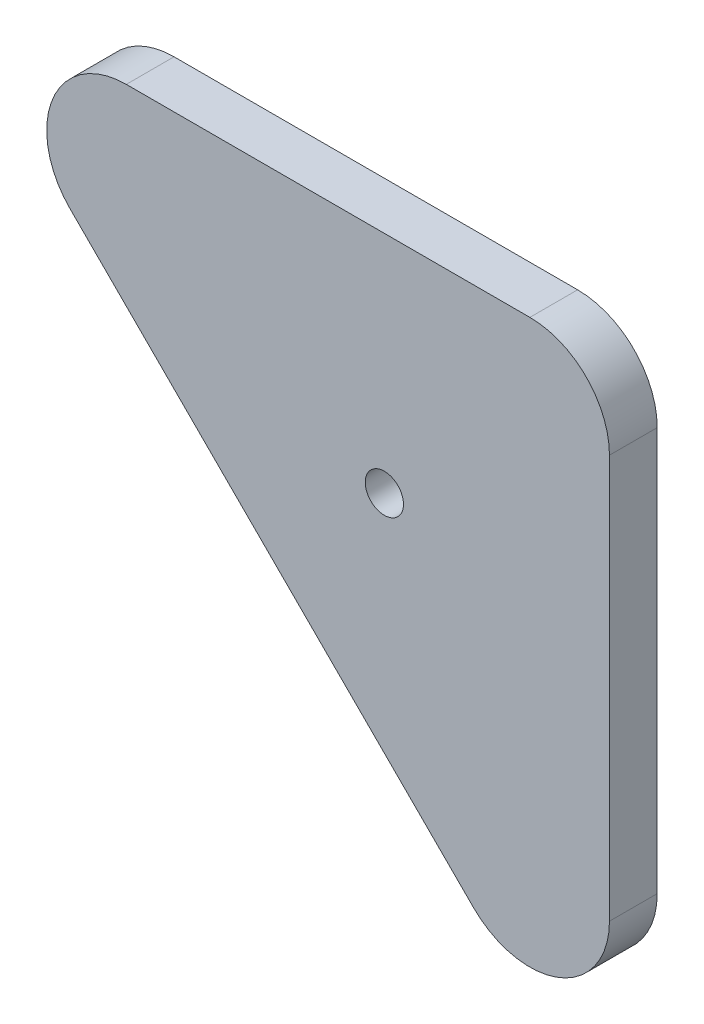
ISO-10303-21;
HEADER;
FILE_DESCRIPTION(('STEP AP214'),'2;1');
FILE_NAME('part.step','',(''),(''),'','','');
FILE_SCHEMA(('AUTOMOTIVE_DESIGN { 1 0 10303 214 1 1 1 1 }'));
ENDSEC;
DATA;
#1=APPLICATION_CONTEXT('core data for automotive mechanical design processes');
#2=APPLICATION_PROTOCOL_DEFINITION('international standard','automotive_design',2000,#1);
#3=PRODUCT_CONTEXT('',#1,'mechanical');
#4=PRODUCT('Part','Part','',(#3));
#5=PRODUCT_RELATED_PRODUCT_CATEGORY('part','',(#4));
#6=PRODUCT_DEFINITION_FORMATION('','',#4);
#7=PRODUCT_DEFINITION_CONTEXT('part definition',#1,'design');
#8=PRODUCT_DEFINITION('design','',#6,#7);
#9=PRODUCT_DEFINITION_SHAPE('','',#8);
#10=(LENGTH_UNIT() NAMED_UNIT(*) SI_UNIT(.MILLI.,.METRE.));
#11=(NAMED_UNIT(*) PLANE_ANGLE_UNIT() SI_UNIT($,.RADIAN.));
#12=(NAMED_UNIT(*) SI_UNIT($,.STERADIAN.) SOLID_ANGLE_UNIT());
#13=UNCERTAINTY_MEASURE_WITH_UNIT(LENGTH_MEASURE(1.E-05),#10,'distance_accuracy_value','');
#14=(GEOMETRIC_REPRESENTATION_CONTEXT(3) GLOBAL_UNCERTAINTY_ASSIGNED_CONTEXT((#13)) GLOBAL_UNIT_ASSIGNED_CONTEXT((#10,
#11,#12)) REPRESENTATION_CONTEXT('',''));
#15=CARTESIAN_POINT('',(0.,0.,0.));
#16=DIRECTION('',(0.,0.,1.));
#17=DIRECTION('',(1.,0.,0.));
#18=AXIS2_PLACEMENT_3D('',#15,#16,#17);
#19=CARTESIAN_POINT('',(509.289321881343,559.999999999999,6.));
#20=DIRECTION('',(0.,0.,-1.));
#21=DIRECTION('',(-1.,0.,0.));
#22=AXIS2_PLACEMENT_3D('',#19,#20,#21);
#23=PLANE('',#22);
#24=CARTESIAN_POINT('',(509.289321881343,559.999999999999,6.));
#25=DIRECTION('',(0.,0.,1.));
#26=DIRECTION('',(-1.,0.,0.));
#27=AXIS2_PLACEMENT_3D('',#24,#25,#26);
#28=CIRCLE('',#27,10.);
#29=CARTESIAN_POINT('',(509.289321881343,569.999999999999,6.));
#30=VERTEX_POINT('',#29);
#31=CARTESIAN_POINT('',(502.218254069477,552.928932188133,6.));
#32=VERTEX_POINT('',#31);
#33=EDGE_CURVE('E126',#30,#32,#28,.T.);
#34=ORIENTED_EDGE('',*,*,#33,.T.);
#35=DIRECTION('',(0.707106781186557,-0.707106781186538,0.));
#36=VECTOR('',#35,1.);
#37=CARTESIAN_POINT('',(552.928932188133,502.218254069479,6.));
#38=LINE('',#37,#36);
#39=CARTESIAN_POINT('',(552.928932188133,502.218254069479,6.));
#40=VERTEX_POINT('',#39);
#41=EDGE_CURVE('E84',#32,#40,#38,.T.);
#42=ORIENTED_EDGE('',*,*,#41,.T.);
#43=CARTESIAN_POINT('',(559.999999999999,509.289321881344,6.));
#44=DIRECTION('',(0.,0.,1.));
#45=DIRECTION('',(1.,0.,0.));
#46=AXIS2_PLACEMENT_3D('',#43,#44,#45);
#47=CIRCLE('',#46,10.);
#48=CARTESIAN_POINT('',(569.999999999999,509.289321881344,6.));
#49=VERTEX_POINT('',#48);
#50=EDGE_CURVE('E97',#40,#49,#47,.T.);
#51=ORIENTED_EDGE('',*,*,#50,.T.);
#52=DIRECTION('',(0.,1.,0.));
#53=VECTOR('',#52,1.);
#54=CARTESIAN_POINT('',(569.999999999999,559.999999999999,6.));
#55=LINE('',#54,#53);
#56=CARTESIAN_POINT('',(569.999999999999,559.999999999999,6.));
#57=VERTEX_POINT('',#56);
#58=EDGE_CURVE('E91',#49,#57,#55,.T.);
#59=ORIENTED_EDGE('',*,*,#58,.T.);
#60=CARTESIAN_POINT('',(559.999999999999,559.999999999999,6.));
#61=DIRECTION('',(0.,0.,1.));
#62=DIRECTION('',(-1.,0.,0.));
#63=AXIS2_PLACEMENT_3D('',#60,#61,#62);
#64=CIRCLE('',#63,9.99999999999995);
#65=CARTESIAN_POINT('',(559.999999999999,569.999999999999,6.));
#66=VERTEX_POINT('',#65);
#67=EDGE_CURVE('E95',#57,#66,#64,.T.);
#68=ORIENTED_EDGE('',*,*,#67,.T.);
#69=DIRECTION('',(-1.,0.,0.));
#70=VECTOR('',#69,1.);
#71=CARTESIAN_POINT('',(509.289321881343,569.999999999999,6.));
#72=LINE('',#71,#70);
#73=EDGE_CURVE('E47',#66,#30,#72,.T.);
#74=ORIENTED_EDGE('',*,*,#73,.T.);
#75=EDGE_LOOP('',(#34,#42,#51,#59,#68,#74));
#76=FACE_BOUND('',#75,.T.);
#77=CARTESIAN_POINT('',(541.715728752537,541.715728752536,6.));
#78=DIRECTION('',(0.,0.,1.));
#79=DIRECTION('',(1.,0.,0.));
#80=AXIS2_PLACEMENT_3D('',#77,#78,#79);
#81=CIRCLE('',#80,2.4000000000001);
#82=CARTESIAN_POINT('',(544.115728752537,541.715728752536,6.));
#83=VERTEX_POINT('',#82);
#84=EDGE_CURVE('E119',#83,#83,#81,.T.);
#85=ORIENTED_EDGE('',*,*,#84,.F.);
#86=EDGE_LOOP('',(#85));
#87=FACE_BOUND('',#86,.T.);
#88=ADVANCED_FACE('F30',(#76,#87),#23,.F.);
#89=CARTESIAN_POINT('',(509.289321881343,559.999999999999,0.));
#90=DIRECTION('',(0.,0.,-1.));
#91=DIRECTION('',(-1.,0.,0.));
#92=AXIS2_PLACEMENT_3D('',#89,#90,#91);
#93=PLANE('',#92);
#94=CARTESIAN_POINT('',(509.289321881343,559.999999999999,0.));
#95=DIRECTION('',(0.,0.,1.));
#96=DIRECTION('',(-1.,0.,0.));
#97=AXIS2_PLACEMENT_3D('',#94,#95,#96);
#98=CIRCLE('',#97,10.);
#99=CARTESIAN_POINT('',(509.289321881343,569.999999999999,0.));
#100=VERTEX_POINT('',#99);
#101=CARTESIAN_POINT('',(502.218254069477,552.928932188133,0.));
#102=VERTEX_POINT('',#101);
#103=EDGE_CURVE('E115',#100,#102,#98,.T.);
#104=ORIENTED_EDGE('',*,*,#103,.F.);
#105=DIRECTION('',(-1.,0.,0.));
#106=VECTOR('',#105,1.);
#107=CARTESIAN_POINT('',(509.289321881343,569.999999999999,0.));
#108=LINE('',#107,#106);
#109=CARTESIAN_POINT('',(559.999999999999,569.999999999999,0.));
#110=VERTEX_POINT('',#109);
#111=EDGE_CURVE('E76',#110,#100,#108,.T.);
#112=ORIENTED_EDGE('',*,*,#111,.F.);
#113=CARTESIAN_POINT('',(559.999999999999,559.999999999999,0.));
#114=DIRECTION('',(0.,0.,1.));
#115=DIRECTION('',(-1.,0.,0.));
#116=AXIS2_PLACEMENT_3D('',#113,#114,#115);
#117=CIRCLE('',#116,9.99999999999995);
#118=CARTESIAN_POINT('',(569.999999999999,559.999999999999,0.));
#119=VERTEX_POINT('',#118);
#120=EDGE_CURVE('E70',#119,#110,#117,.T.);
#121=ORIENTED_EDGE('',*,*,#120,.F.);
#122=DIRECTION('',(0.,1.,0.));
#123=VECTOR('',#122,1.);
#124=CARTESIAN_POINT('',(569.999999999999,559.999999999999,0.));
#125=LINE('',#124,#123);
#126=CARTESIAN_POINT('',(569.999999999999,509.289321881344,0.));
#127=VERTEX_POINT('',#126);
#128=EDGE_CURVE('E105',#127,#119,#125,.T.);
#129=ORIENTED_EDGE('',*,*,#128,.F.);
#130=CARTESIAN_POINT('',(559.999999999999,509.289321881344,0.));
#131=DIRECTION('',(0.,0.,1.));
#132=DIRECTION('',(1.,0.,0.));
#133=AXIS2_PLACEMENT_3D('',#130,#131,#132);
#134=CIRCLE('',#133,10.);
#135=CARTESIAN_POINT('',(552.928932188133,502.218254069479,0.));
#136=VERTEX_POINT('',#135);
#137=EDGE_CURVE('E121',#136,#127,#134,.T.);
#138=ORIENTED_EDGE('',*,*,#137,.F.);
#139=DIRECTION('',(0.707106781186557,-0.707106781186538,0.));
#140=VECTOR('',#139,1.);
#141=CARTESIAN_POINT('',(552.928932188133,502.218254069479,0.));
#142=LINE('',#141,#140);
#143=EDGE_CURVE('E118',#102,#136,#142,.T.);
#144=ORIENTED_EDGE('',*,*,#143,.F.);
#145=EDGE_LOOP('',(#104,#112,#121,#129,#138,#144));
#146=FACE_BOUND('',#145,.T.);
#147=CARTESIAN_POINT('',(541.715728752537,541.715728752536,0.));
#148=DIRECTION('',(0.,0.,1.));
#149=DIRECTION('',(1.,0.,0.));
#150=AXIS2_PLACEMENT_3D('',#147,#148,#149);
#151=CIRCLE('',#150,2.4000000000001);
#152=CARTESIAN_POINT('',(544.115728752537,541.715728752536,0.));
#153=VERTEX_POINT('',#152);
#154=EDGE_CURVE('E219',#153,#153,#151,.T.);
#155=ORIENTED_EDGE('',*,*,#154,.T.);
#156=EDGE_LOOP('',(#155));
#157=FACE_BOUND('',#156,.T.);
#158=ADVANCED_FACE('F135',(#146,#157),#93,.T.);
#159=CARTESIAN_POINT('',(509.289321881343,559.999999999999,6.));
#160=DIRECTION('',(0.,0.,-1.));
#161=DIRECTION('',(-1.,0.,0.));
#162=AXIS2_PLACEMENT_3D('',#159,#160,#161);
#163=CYLINDRICAL_SURFACE('',#162,10.);
#164=ORIENTED_EDGE('',*,*,#103,.T.);
#165=DIRECTION('',(0.,0.,-1.));
#166=VECTOR('',#165,1.);
#167=CARTESIAN_POINT('',(502.218254069477,552.928932188133,6.));
#168=LINE('',#167,#166);
#169=EDGE_CURVE('E11',#32,#102,#168,.T.);
#170=ORIENTED_EDGE('',*,*,#169,.F.);
#171=ORIENTED_EDGE('',*,*,#33,.F.);
#172=DIRECTION('',(0.,0.,-1.));
#173=VECTOR('',#172,1.);
#174=CARTESIAN_POINT('',(509.289321881343,569.999999999999,6.));
#175=LINE('',#174,#173);
#176=EDGE_CURVE('E111',#30,#100,#175,.T.);
#177=ORIENTED_EDGE('',*,*,#176,.T.);
#178=EDGE_LOOP('',(#164,#170,#171,#177));
#179=FACE_BOUND('',#178,.T.);
#180=ADVANCED_FACE('F32',(#179),#163,.T.);
#181=CARTESIAN_POINT('',(552.928932188133,502.218254069479,6.));
#182=DIRECTION('',(0.707106781186538,0.707106781186557,0.));
#183=DIRECTION('',(-0.707106781186557,0.707106781186538,0.));
#184=AXIS2_PLACEMENT_3D('',#181,#182,#183);
#185=PLANE('',#184);
#186=ORIENTED_EDGE('',*,*,#143,.T.);
#187=DIRECTION('',(0.,0.,-1.));
#188=VECTOR('',#187,1.);
#189=CARTESIAN_POINT('',(552.928932188133,502.218254069479,6.));
#190=LINE('',#189,#188);
#191=EDGE_CURVE('E39',#40,#136,#190,.T.);
#192=ORIENTED_EDGE('',*,*,#191,.F.);
#193=ORIENTED_EDGE('',*,*,#41,.F.);
#194=ORIENTED_EDGE('',*,*,#169,.T.);
#195=EDGE_LOOP('',(#186,#192,#193,#194));
#196=FACE_BOUND('',#195,.T.);
#197=ADVANCED_FACE('F160',(#196),#185,.F.);
#198=CARTESIAN_POINT('',(559.999999999999,509.289321881344,6.));
#199=DIRECTION('',(0.,0.,-1.));
#200=DIRECTION('',(-1.,0.,0.));
#201=AXIS2_PLACEMENT_3D('',#198,#199,#200);
#202=CYLINDRICAL_SURFACE('',#201,10.);
#203=ORIENTED_EDGE('',*,*,#137,.T.);
#204=DIRECTION('',(0.,0.,-1.));
#205=VECTOR('',#204,1.);
#206=CARTESIAN_POINT('',(569.999999999999,509.289321881344,6.));
#207=LINE('',#206,#205);
#208=EDGE_CURVE('E106',#49,#127,#207,.T.);
#209=ORIENTED_EDGE('',*,*,#208,.F.);
#210=ORIENTED_EDGE('',*,*,#50,.F.);
#211=ORIENTED_EDGE('',*,*,#191,.T.);
#212=EDGE_LOOP('',(#203,#209,#210,#211));
#213=FACE_BOUND('',#212,.T.);
#214=ADVANCED_FACE('F132',(#213),#202,.T.);
#215=CARTESIAN_POINT('',(569.999999999999,559.999999999999,6.));
#216=DIRECTION('',(-1.,0.,0.));
#217=DIRECTION('',(0.,0.,1.));
#218=AXIS2_PLACEMENT_3D('',#215,#216,#217);
#219=PLANE('',#218);
#220=ORIENTED_EDGE('',*,*,#128,.T.);
#221=DIRECTION('',(0.,0.,-1.));
#222=VECTOR('',#221,1.);
#223=CARTESIAN_POINT('',(569.999999999999,559.999999999999,6.));
#224=LINE('',#223,#222);
#225=EDGE_CURVE('E102',#57,#119,#224,.T.);
#226=ORIENTED_EDGE('',*,*,#225,.F.);
#227=ORIENTED_EDGE('',*,*,#58,.F.);
#228=ORIENTED_EDGE('',*,*,#208,.T.);
#229=EDGE_LOOP('',(#220,#226,#227,#228));
#230=FACE_BOUND('',#229,.T.);
#231=ADVANCED_FACE('F103',(#230),#219,.F.);
#232=CARTESIAN_POINT('',(559.999999999999,559.999999999999,6.));
#233=DIRECTION('',(0.,0.,-1.));
#234=DIRECTION('',(-1.,0.,0.));
#235=AXIS2_PLACEMENT_3D('',#232,#233,#234);
#236=CYLINDRICAL_SURFACE('',#235,9.99999999999995);
#237=ORIENTED_EDGE('',*,*,#120,.T.);
#238=DIRECTION('',(0.,0.,-1.));
#239=VECTOR('',#238,1.);
#240=CARTESIAN_POINT('',(559.999999999999,569.999999999999,6.));
#241=LINE('',#240,#239);
#242=EDGE_CURVE('E107',#66,#110,#241,.T.);
#243=ORIENTED_EDGE('',*,*,#242,.F.);
#244=ORIENTED_EDGE('',*,*,#67,.F.);
#245=ORIENTED_EDGE('',*,*,#225,.T.);
#246=EDGE_LOOP('',(#237,#243,#244,#245));
#247=FACE_BOUND('',#246,.T.);
#248=ADVANCED_FACE('F109',(#247),#236,.T.);
#249=CARTESIAN_POINT('',(509.289321881343,569.999999999999,6.));
#250=DIRECTION('',(0.,-1.,0.));
#251=DIRECTION('',(1.,0.,0.));
#252=AXIS2_PLACEMENT_3D('',#249,#250,#251);
#253=PLANE('',#252);
#254=ORIENTED_EDGE('',*,*,#111,.T.);
#255=ORIENTED_EDGE('',*,*,#176,.F.);
#256=ORIENTED_EDGE('',*,*,#73,.F.);
#257=ORIENTED_EDGE('',*,*,#242,.T.);
#258=EDGE_LOOP('',(#254,#255,#256,#257));
#259=FACE_BOUND('',#258,.T.);
#260=ADVANCED_FACE('F140',(#259),#253,.F.);
#261=CARTESIAN_POINT('',(541.715728752537,541.715728752536,6.));
#262=DIRECTION('',(0.,0.,-1.));
#263=DIRECTION('',(-1.,0.,0.));
#264=AXIS2_PLACEMENT_3D('',#261,#262,#263);
#265=CYLINDRICAL_SURFACE('',#264,2.4000000000001);
#266=ORIENTED_EDGE('',*,*,#84,.T.);
#267=EDGE_LOOP('',(#266));
#268=FACE_BOUND('',#267,.T.);
#269=ORIENTED_EDGE('',*,*,#154,.F.);
#270=EDGE_LOOP('',(#269));
#271=FACE_BOUND('',#270,.T.);
#272=ADVANCED_FACE('F142',(#268,#271),#265,.F.);
#273=CLOSED_SHELL('',(#88,#158,#180,#197,#214,#231,#248,#260,#272));
#274=MANIFOLD_SOLID_BREP('B2',#273);
#275=ADVANCED_BREP_SHAPE_REPRESENTATION('',(#18,#274),#14);
#276=SHAPE_DEFINITION_REPRESENTATION(#9,#275);
ENDSEC;
END-ISO-10303-21;
